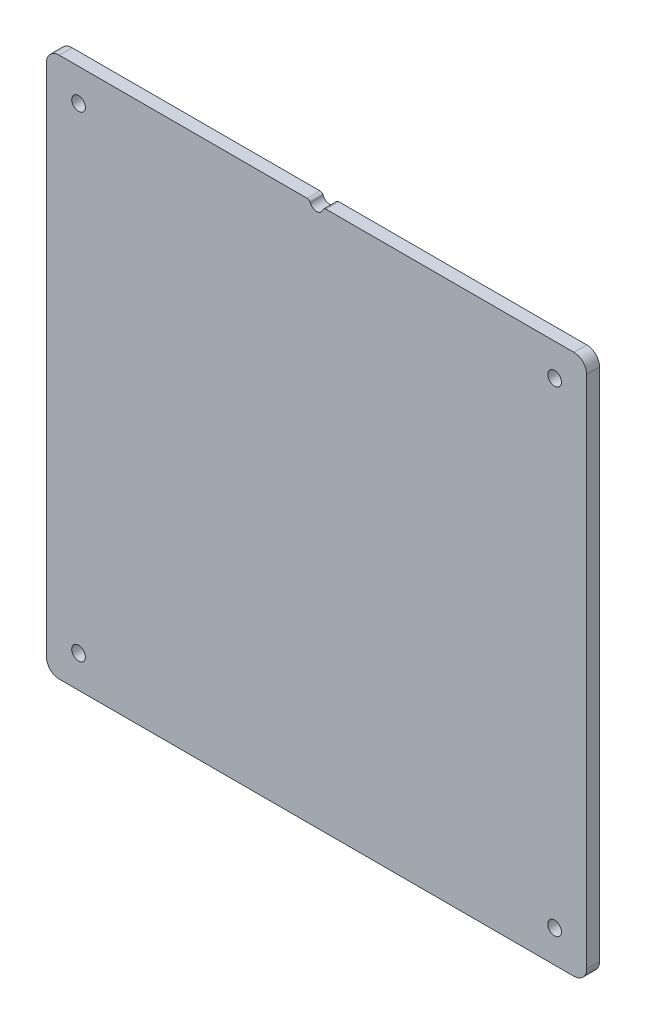
ISO-10303-21;
HEADER;
FILE_DESCRIPTION(('STEP AP214'),'2;1');
FILE_NAME('part.step','',(''),(''),'','','');
FILE_SCHEMA(('AUTOMOTIVE_DESIGN { 1 0 10303 214 1 1 1 1 }'));
ENDSEC;
DATA;
#1=APPLICATION_CONTEXT('core data for automotive mechanical design processes');
#2=APPLICATION_PROTOCOL_DEFINITION('international standard','automotive_design',2000,#1);
#3=PRODUCT_CONTEXT('',#1,'mechanical');
#4=PRODUCT('Part','Part','',(#3));
#5=PRODUCT_RELATED_PRODUCT_CATEGORY('part','',(#4));
#6=PRODUCT_DEFINITION_FORMATION('','',#4);
#7=PRODUCT_DEFINITION_CONTEXT('part definition',#1,'design');
#8=PRODUCT_DEFINITION('design','',#6,#7);
#9=PRODUCT_DEFINITION_SHAPE('','',#8);
#10=(LENGTH_UNIT() NAMED_UNIT(*) SI_UNIT(.MILLI.,.METRE.));
#11=(NAMED_UNIT(*) PLANE_ANGLE_UNIT() SI_UNIT($,.RADIAN.));
#12=(NAMED_UNIT(*) SI_UNIT($,.STERADIAN.) SOLID_ANGLE_UNIT());
#13=UNCERTAINTY_MEASURE_WITH_UNIT(LENGTH_MEASURE(1.E-05),#10,'distance_accuracy_value','');
#14=(GEOMETRIC_REPRESENTATION_CONTEXT(3) GLOBAL_UNCERTAINTY_ASSIGNED_CONTEXT((#13)) GLOBAL_UNIT_ASSIGNED_CONTEXT((#10,
#11,#12)) REPRESENTATION_CONTEXT('',''));
#15=CARTESIAN_POINT('',(0.,0.,0.));
#16=DIRECTION('',(0.,0.,1.));
#17=DIRECTION('',(1.,0.,0.));
#18=AXIS2_PLACEMENT_3D('',#15,#16,#17);
#19=CARTESIAN_POINT('',(-133.35,133.35,6.35));
#20=DIRECTION('',(0.,-1.,0.));
#21=DIRECTION('',(0.,0.,-1.));
#22=AXIS2_PLACEMENT_3D('',#19,#20,#21);
#23=PLANE('',#22);
#24=DIRECTION('',(-1.,0.,0.));
#25=VECTOR('',#24,1.);
#26=CARTESIAN_POINT('',(-133.35,133.35,0.));
#27=LINE('',#26,#25);
#28=CARTESIAN_POINT('',(127.,133.35,0.));
#29=VERTEX_POINT('',#28);
#30=CARTESIAN_POINT('',(4.6246139298324,133.35,0.));
#31=VERTEX_POINT('',#30);
#32=EDGE_CURVE('E158',#29,#31,#27,.T.);
#33=ORIENTED_EDGE('',*,*,#32,.T.);
#34=DIRECTION('',(0.,0.,1.));
#35=VECTOR('',#34,1.);
#36=CARTESIAN_POINT('',(4.6246139298324,133.35,6.35));
#37=LINE('',#36,#35);
#38=CARTESIAN_POINT('',(4.6246139298324,133.35,6.35));
#39=VERTEX_POINT('',#38);
#40=EDGE_CURVE('E200',#31,#39,#37,.T.);
#41=ORIENTED_EDGE('',*,*,#40,.T.);
#42=DIRECTION('',(-1.,0.,0.));
#43=VECTOR('',#42,1.);
#44=CARTESIAN_POINT('',(-133.35,133.35,6.35));
#45=LINE('',#44,#43);
#46=CARTESIAN_POINT('',(127.,133.35,6.35));
#47=VERTEX_POINT('',#46);
#48=EDGE_CURVE('E225',#47,#39,#45,.T.);
#49=ORIENTED_EDGE('',*,*,#48,.F.);
#50=DIRECTION('',(0.,0.,-1.));
#51=VECTOR('',#50,1.);
#52=CARTESIAN_POINT('',(127.,133.35,6.35));
#53=LINE('',#52,#51);
#54=EDGE_CURVE('E197',#47,#29,#53,.T.);
#55=ORIENTED_EDGE('',*,*,#54,.T.);
#56=EDGE_LOOP('',(#33,#41,#49,#55));
#57=FACE_BOUND('',#56,.T.);
#58=ADVANCED_FACE('F36',(#57),#23,.F.);
#59=CARTESIAN_POINT('',(0.,0.,6.35));
#60=DIRECTION('',(0.,0.,-1.));
#61=DIRECTION('',(-1.,0.,0.));
#62=AXIS2_PLACEMENT_3D('',#59,#60,#61);
#63=PLANE('',#62);
#64=CARTESIAN_POINT('',(-117.475,-117.475,6.35));
#65=DIRECTION('',(0.,0.,1.));
#66=DIRECTION('',(1.,0.,0.));
#67=AXIS2_PLACEMENT_3D('',#64,#65,#66);
#68=CIRCLE('',#67,3.37819999999998);
#69=CARTESIAN_POINT('',(-114.0968,-117.475,6.35));
#70=VERTEX_POINT('',#69);
#71=EDGE_CURVE('E236',#70,#70,#68,.T.);
#72=ORIENTED_EDGE('',*,*,#71,.F.);
#73=EDGE_LOOP('',(#72));
#74=FACE_BOUND('',#73,.T.);
#75=CARTESIAN_POINT('',(117.475,-117.475,6.35));
#76=DIRECTION('',(0.,0.,1.));
#77=DIRECTION('',(1.,0.,0.));
#78=AXIS2_PLACEMENT_3D('',#75,#76,#77);
#79=CIRCLE('',#78,3.37819999999998);
#80=CARTESIAN_POINT('',(120.8532,-117.475,6.35));
#81=VERTEX_POINT('',#80);
#82=EDGE_CURVE('E242',#81,#81,#79,.T.);
#83=ORIENTED_EDGE('',*,*,#82,.F.);
#84=EDGE_LOOP('',(#83));
#85=FACE_BOUND('',#84,.T.);
#86=CARTESIAN_POINT('',(117.475,117.475,6.35));
#87=DIRECTION('',(0.,0.,1.));
#88=DIRECTION('',(1.,0.,0.));
#89=AXIS2_PLACEMENT_3D('',#86,#87,#88);
#90=CIRCLE('',#89,3.37819999999998);
#91=CARTESIAN_POINT('',(120.8532,117.475,6.35));
#92=VERTEX_POINT('',#91);
#93=EDGE_CURVE('E161',#92,#92,#90,.T.);
#94=ORIENTED_EDGE('',*,*,#93,.F.);
#95=EDGE_LOOP('',(#94));
#96=FACE_BOUND('',#95,.T.);
#97=ORIENTED_EDGE('',*,*,#48,.T.);
#98=CARTESIAN_POINT('',(4.62461392983241,131.7625,6.35));
#99=DIRECTION('',(0.,0.,-1.));
#100=DIRECTION('',(-1.,0.,0.));
#101=AXIS2_PLACEMENT_3D('',#98,#99,#100);
#102=CIRCLE('',#101,1.5875);
#103=CARTESIAN_POINT('',(3.12311590066604,132.277922077922,6.35));
#104=VERTEX_POINT('',#103);
#105=EDGE_CURVE('E205',#39,#104,#102,.F.);
#106=ORIENTED_EDGE('',*,*,#105,.T.);
#107=CARTESIAN_POINT('',(0.,133.35,6.35));
#108=DIRECTION('',(0.,0.,1.));
#109=DIRECTION('',(1.,0.,0.));
#110=AXIS2_PLACEMENT_3D('',#107,#108,#109);
#111=CIRCLE('',#110,3.302);
#112=CARTESIAN_POINT('',(-3.12311590066604,132.277922077922,6.35));
#113=VERTEX_POINT('',#112);
#114=EDGE_CURVE('E223',#113,#104,#111,.T.);
#115=ORIENTED_EDGE('',*,*,#114,.F.);
#116=CARTESIAN_POINT('',(-4.62461392983241,131.7625,6.35));
#117=DIRECTION('',(0.,0.,-1.));
#118=DIRECTION('',(-1.,0.,0.));
#119=AXIS2_PLACEMENT_3D('',#116,#117,#118);
#120=CIRCLE('',#119,1.5875);
#121=CARTESIAN_POINT('',(-4.6246139298324,133.35,6.35));
#122=VERTEX_POINT('',#121);
#123=EDGE_CURVE('E203',#113,#122,#120,.F.);
#124=ORIENTED_EDGE('',*,*,#123,.T.);
#125=CARTESIAN_POINT('',(-127.,133.35,6.35));
#126=VERTEX_POINT('',#125);
#127=EDGE_CURVE('E251',#122,#126,#45,.T.);
#128=ORIENTED_EDGE('',*,*,#127,.T.);
#129=CARTESIAN_POINT('',(-127.,127.,6.35));
#130=DIRECTION('',(0.,0.,-1.));
#131=DIRECTION('',(-1.,0.,0.));
#132=AXIS2_PLACEMENT_3D('',#129,#130,#131);
#133=CIRCLE('',#132,6.35);
#134=CARTESIAN_POINT('',(-133.35,127.,6.35));
#135=VERTEX_POINT('',#134);
#136=EDGE_CURVE('E181',#126,#135,#133,.F.);
#137=ORIENTED_EDGE('',*,*,#136,.T.);
#138=DIRECTION('',(0.,-1.,0.));
#139=VECTOR('',#138,1.);
#140=CARTESIAN_POINT('',(-133.35,-133.35,6.35));
#141=LINE('',#140,#139);
#142=CARTESIAN_POINT('',(-133.35,-127.,6.35));
#143=VERTEX_POINT('',#142);
#144=EDGE_CURVE('E252',#135,#143,#141,.T.);
#145=ORIENTED_EDGE('',*,*,#144,.T.);
#146=CARTESIAN_POINT('',(-127.,-127.,6.35));
#147=DIRECTION('',(0.,0.,-1.));
#148=DIRECTION('',(-1.,0.,0.));
#149=AXIS2_PLACEMENT_3D('',#146,#147,#148);
#150=CIRCLE('',#149,6.35);
#151=CARTESIAN_POINT('',(-127.,-133.35,6.35));
#152=VERTEX_POINT('',#151);
#153=EDGE_CURVE('E185',#143,#152,#150,.F.);
#154=ORIENTED_EDGE('',*,*,#153,.T.);
#155=DIRECTION('',(1.,0.,0.));
#156=VECTOR('',#155,1.);
#157=CARTESIAN_POINT('',(-133.35,-133.35,6.35));
#158=LINE('',#157,#156);
#159=CARTESIAN_POINT('',(127.,-133.35,6.35));
#160=VERTEX_POINT('',#159);
#161=EDGE_CURVE('E164',#152,#160,#158,.T.);
#162=ORIENTED_EDGE('',*,*,#161,.T.);
#163=CARTESIAN_POINT('',(127.,-127.,6.35));
#164=DIRECTION('',(0.,0.,-1.));
#165=DIRECTION('',(-1.,0.,0.));
#166=AXIS2_PLACEMENT_3D('',#163,#164,#165);
#167=CIRCLE('',#166,6.35);
#168=CARTESIAN_POINT('',(133.35,-127.,6.35));
#169=VERTEX_POINT('',#168);
#170=EDGE_CURVE('E187',#160,#169,#167,.F.);
#171=ORIENTED_EDGE('',*,*,#170,.T.);
#172=DIRECTION('',(0.,1.,0.));
#173=VECTOR('',#172,1.);
#174=CARTESIAN_POINT('',(133.35,-133.35,6.35));
#175=LINE('',#174,#173);
#176=CARTESIAN_POINT('',(133.35,127.,6.35));
#177=VERTEX_POINT('',#176);
#178=EDGE_CURVE('E147',#169,#177,#175,.T.);
#179=ORIENTED_EDGE('',*,*,#178,.T.);
#180=CARTESIAN_POINT('',(127.,127.,6.35));
#181=DIRECTION('',(0.,0.,-1.));
#182=DIRECTION('',(-1.,0.,0.));
#183=AXIS2_PLACEMENT_3D('',#180,#181,#182);
#184=CIRCLE('',#183,6.35);
#185=EDGE_CURVE('E183',#177,#47,#184,.F.);
#186=ORIENTED_EDGE('',*,*,#185,.T.);
#187=EDGE_LOOP('',(#97,#106,#115,#124,#128,#137,#145,#154,#162,#171,#179,#186));
#188=FACE_BOUND('',#187,.T.);
#189=CARTESIAN_POINT('',(-117.475,117.475,6.35));
#190=DIRECTION('',(0.,0.,1.));
#191=DIRECTION('',(1.,0.,0.));
#192=AXIS2_PLACEMENT_3D('',#189,#190,#191);
#193=CIRCLE('',#192,3.37819999999998);
#194=CARTESIAN_POINT('',(-114.0968,117.475,6.35));
#195=VERTEX_POINT('',#194);
#196=EDGE_CURVE('E228',#195,#195,#193,.T.);
#197=ORIENTED_EDGE('',*,*,#196,.F.);
#198=EDGE_LOOP('',(#197));
#199=FACE_BOUND('',#198,.T.);
#200=ADVANCED_FACE('F221',(#74,#85,#96,#188,#199),#63,.F.);
#201=CARTESIAN_POINT('',(0.,0.,0.));
#202=DIRECTION('',(0.,0.,-1.));
#203=DIRECTION('',(-1.,0.,0.));
#204=AXIS2_PLACEMENT_3D('',#201,#202,#203);
#205=PLANE('',#204);
#206=CARTESIAN_POINT('',(0.,133.35,0.));
#207=DIRECTION('',(0.,0.,1.));
#208=DIRECTION('',(1.,0.,0.));
#209=AXIS2_PLACEMENT_3D('',#206,#207,#208);
#210=CIRCLE('',#209,3.302);
#211=CARTESIAN_POINT('',(-3.12311590066604,132.277922077922,0.));
#212=VERTEX_POINT('',#211);
#213=CARTESIAN_POINT('',(3.12311590066604,132.277922077922,0.));
#214=VERTEX_POINT('',#213);
#215=EDGE_CURVE('E211',#212,#214,#210,.T.);
#216=ORIENTED_EDGE('',*,*,#215,.T.);
#217=CARTESIAN_POINT('',(4.62461392983241,131.7625,0.));
#218=DIRECTION('',(0.,0.,-1.));
#219=DIRECTION('',(-1.,0.,0.));
#220=AXIS2_PLACEMENT_3D('',#217,#218,#219);
#221=CIRCLE('',#220,1.5875);
#222=EDGE_CURVE('E44',#214,#31,#221,.T.);
#223=ORIENTED_EDGE('',*,*,#222,.T.);
#224=ORIENTED_EDGE('',*,*,#32,.F.);
#225=CARTESIAN_POINT('',(127.,127.,0.));
#226=DIRECTION('',(0.,0.,-1.));
#227=DIRECTION('',(-1.,0.,0.));
#228=AXIS2_PLACEMENT_3D('',#225,#226,#227);
#229=CIRCLE('',#228,6.35);
#230=CARTESIAN_POINT('',(133.35,127.,0.));
#231=VERTEX_POINT('',#230);
#232=EDGE_CURVE('E154',#29,#231,#229,.T.);
#233=ORIENTED_EDGE('',*,*,#232,.T.);
#234=DIRECTION('',(0.,1.,0.));
#235=VECTOR('',#234,1.);
#236=CARTESIAN_POINT('',(133.35,-133.35,0.));
#237=LINE('',#236,#235);
#238=CARTESIAN_POINT('',(133.35,-127.,0.));
#239=VERTEX_POINT('',#238);
#240=EDGE_CURVE('E144',#239,#231,#237,.T.);
#241=ORIENTED_EDGE('',*,*,#240,.F.);
#242=CARTESIAN_POINT('',(127.,-127.,0.));
#243=DIRECTION('',(0.,0.,-1.));
#244=DIRECTION('',(-1.,0.,0.));
#245=AXIS2_PLACEMENT_3D('',#242,#243,#244);
#246=CIRCLE('',#245,6.35);
#247=CARTESIAN_POINT('',(127.,-133.35,0.));
#248=VERTEX_POINT('',#247);
#249=EDGE_CURVE('E127',#239,#248,#246,.T.);
#250=ORIENTED_EDGE('',*,*,#249,.T.);
#251=DIRECTION('',(1.,0.,0.));
#252=VECTOR('',#251,1.);
#253=CARTESIAN_POINT('',(-133.35,-133.35,0.));
#254=LINE('',#253,#252);
#255=CARTESIAN_POINT('',(-127.,-133.35,0.));
#256=VERTEX_POINT('',#255);
#257=EDGE_CURVE('E171',#256,#248,#254,.T.);
#258=ORIENTED_EDGE('',*,*,#257,.F.);
#259=CARTESIAN_POINT('',(-127.,-127.,0.));
#260=DIRECTION('',(0.,0.,-1.));
#261=DIRECTION('',(-1.,0.,0.));
#262=AXIS2_PLACEMENT_3D('',#259,#260,#261);
#263=CIRCLE('',#262,6.35);
#264=CARTESIAN_POINT('',(-133.35,-127.,0.));
#265=VERTEX_POINT('',#264);
#266=EDGE_CURVE('E138',#256,#265,#263,.T.);
#267=ORIENTED_EDGE('',*,*,#266,.T.);
#268=DIRECTION('',(0.,-1.,0.));
#269=VECTOR('',#268,1.);
#270=CARTESIAN_POINT('',(-133.35,-133.35,0.));
#271=LINE('',#270,#269);
#272=CARTESIAN_POINT('',(-133.35,127.,0.));
#273=VERTEX_POINT('',#272);
#274=EDGE_CURVE('E168',#273,#265,#271,.T.);
#275=ORIENTED_EDGE('',*,*,#274,.F.);
#276=CARTESIAN_POINT('',(-127.,127.,0.));
#277=DIRECTION('',(0.,0.,-1.));
#278=DIRECTION('',(-1.,0.,0.));
#279=AXIS2_PLACEMENT_3D('',#276,#277,#278);
#280=CIRCLE('',#279,6.35);
#281=CARTESIAN_POINT('',(-127.,133.35,0.));
#282=VERTEX_POINT('',#281);
#283=EDGE_CURVE('E148',#273,#282,#280,.T.);
#284=ORIENTED_EDGE('',*,*,#283,.T.);
#285=CARTESIAN_POINT('',(-4.6246139298324,133.35,0.));
#286=VERTEX_POINT('',#285);
#287=EDGE_CURVE('E155',#286,#282,#27,.T.);
#288=ORIENTED_EDGE('',*,*,#287,.F.);
#289=CARTESIAN_POINT('',(-4.62461392983241,131.7625,0.));
#290=DIRECTION('',(0.,0.,-1.));
#291=DIRECTION('',(-1.,0.,0.));
#292=AXIS2_PLACEMENT_3D('',#289,#290,#291);
#293=CIRCLE('',#292,1.5875);
#294=EDGE_CURVE('E51',#286,#212,#293,.T.);
#295=ORIENTED_EDGE('',*,*,#294,.T.);
#296=EDGE_LOOP('',(#216,#223,#224,#233,#241,#250,#258,#267,#275,#284,#288,#295));
#297=FACE_BOUND('',#296,.T.);
#298=CARTESIAN_POINT('',(-117.475,117.475,0.));
#299=DIRECTION('',(0.,0.,1.));
#300=DIRECTION('',(1.,0.,0.));
#301=AXIS2_PLACEMENT_3D('',#298,#299,#300);
#302=CIRCLE('',#301,3.37819999999993);
#303=CARTESIAN_POINT('',(-114.0968,117.475,0.));
#304=VERTEX_POINT('',#303);
#305=EDGE_CURVE('E233',#304,#304,#302,.T.);
#306=ORIENTED_EDGE('',*,*,#305,.T.);
#307=EDGE_LOOP('',(#306));
#308=FACE_BOUND('',#307,.T.);
#309=CARTESIAN_POINT('',(-117.475,-117.475,0.));
#310=DIRECTION('',(0.,0.,1.));
#311=DIRECTION('',(1.,0.,0.));
#312=AXIS2_PLACEMENT_3D('',#309,#310,#311);
#313=CIRCLE('',#312,3.37819999999993);
#314=CARTESIAN_POINT('',(-114.0968,-117.475,0.));
#315=VERTEX_POINT('',#314);
#316=EDGE_CURVE('E239',#315,#315,#313,.T.);
#317=ORIENTED_EDGE('',*,*,#316,.T.);
#318=EDGE_LOOP('',(#317));
#319=FACE_BOUND('',#318,.T.);
#320=CARTESIAN_POINT('',(117.475,117.475,0.));
#321=DIRECTION('',(0.,0.,1.));
#322=DIRECTION('',(1.,0.,0.));
#323=AXIS2_PLACEMENT_3D('',#320,#321,#322);
#324=CIRCLE('',#323,3.37819999999993);
#325=CARTESIAN_POINT('',(120.8532,117.475,0.));
#326=VERTEX_POINT('',#325);
#327=EDGE_CURVE('E156',#326,#326,#324,.T.);
#328=ORIENTED_EDGE('',*,*,#327,.T.);
#329=EDGE_LOOP('',(#328));
#330=FACE_BOUND('',#329,.T.);
#331=CARTESIAN_POINT('',(117.475,-117.475,0.));
#332=DIRECTION('',(0.,0.,1.));
#333=DIRECTION('',(1.,0.,0.));
#334=AXIS2_PLACEMENT_3D('',#331,#332,#333);
#335=CIRCLE('',#334,3.37819999999993);
#336=CARTESIAN_POINT('',(120.8532,-117.475,0.));
#337=VERTEX_POINT('',#336);
#338=EDGE_CURVE('E245',#337,#337,#335,.T.);
#339=ORIENTED_EDGE('',*,*,#338,.T.);
#340=EDGE_LOOP('',(#339));
#341=FACE_BOUND('',#340,.T.);
#342=ADVANCED_FACE('F151',(#297,#308,#319,#330,#341),#205,.T.);
#343=CARTESIAN_POINT('',(133.35,-133.35,6.35));
#344=DIRECTION('',(-1.,0.,0.));
#345=DIRECTION('',(0.,0.,1.));
#346=AXIS2_PLACEMENT_3D('',#343,#344,#345);
#347=PLANE('',#346);
#348=ORIENTED_EDGE('',*,*,#178,.F.);
#349=DIRECTION('',(0.,0.,-1.));
#350=VECTOR('',#349,1.);
#351=CARTESIAN_POINT('',(133.35,-127.,6.35));
#352=LINE('',#351,#350);
#353=EDGE_CURVE('E131',#169,#239,#352,.T.);
#354=ORIENTED_EDGE('',*,*,#353,.T.);
#355=ORIENTED_EDGE('',*,*,#240,.T.);
#356=DIRECTION('',(0.,0.,-1.));
#357=VECTOR('',#356,1.);
#358=CARTESIAN_POINT('',(133.35,127.,6.35));
#359=LINE('',#358,#357);
#360=EDGE_CURVE('E149',#231,#177,#359,.F.);
#361=ORIENTED_EDGE('',*,*,#360,.T.);
#362=EDGE_LOOP('',(#348,#354,#355,#361));
#363=FACE_BOUND('',#362,.T.);
#364=ADVANCED_FACE('F143',(#363),#347,.F.);
#365=ORIENTED_EDGE('',*,*,#127,.F.);
#366=DIRECTION('',(0.,0.,1.));
#367=VECTOR('',#366,1.);
#368=CARTESIAN_POINT('',(-4.6246139298324,133.35,6.35));
#369=LINE('',#368,#367);
#370=EDGE_CURVE('E11',#122,#286,#369,.F.);
#371=ORIENTED_EDGE('',*,*,#370,.T.);
#372=ORIENTED_EDGE('',*,*,#287,.T.);
#373=DIRECTION('',(0.,0.,-1.));
#374=VECTOR('',#373,1.);
#375=CARTESIAN_POINT('',(-127.,133.35,6.35));
#376=LINE('',#375,#374);
#377=EDGE_CURVE('E194',#282,#126,#376,.F.);
#378=ORIENTED_EDGE('',*,*,#377,.T.);
#379=EDGE_LOOP('',(#365,#371,#372,#378));
#380=FACE_BOUND('',#379,.T.);
#381=ADVANCED_FACE('F275',(#380),#23,.F.);
#382=CARTESIAN_POINT('',(-133.35,-133.35,6.35));
#383=DIRECTION('',(1.,0.,0.));
#384=DIRECTION('',(0.,0.,-1.));
#385=AXIS2_PLACEMENT_3D('',#382,#383,#384);
#386=PLANE('',#385);
#387=ORIENTED_EDGE('',*,*,#274,.T.);
#388=DIRECTION('',(0.,0.,-1.));
#389=VECTOR('',#388,1.);
#390=CARTESIAN_POINT('',(-133.35,-127.,6.35));
#391=LINE('',#390,#389);
#392=EDGE_CURVE('E192',#265,#143,#391,.F.);
#393=ORIENTED_EDGE('',*,*,#392,.T.);
#394=ORIENTED_EDGE('',*,*,#144,.F.);
#395=DIRECTION('',(0.,0.,-1.));
#396=VECTOR('',#395,1.);
#397=CARTESIAN_POINT('',(-133.35,127.,6.35));
#398=LINE('',#397,#396);
#399=EDGE_CURVE('E189',#135,#273,#398,.T.);
#400=ORIENTED_EDGE('',*,*,#399,.T.);
#401=EDGE_LOOP('',(#387,#393,#394,#400));
#402=FACE_BOUND('',#401,.T.);
#403=ADVANCED_FACE('F266',(#402),#386,.F.);
#404=CARTESIAN_POINT('',(-133.35,-133.35,6.35));
#405=DIRECTION('',(0.,1.,0.));
#406=DIRECTION('',(0.,0.,1.));
#407=AXIS2_PLACEMENT_3D('',#404,#405,#406);
#408=PLANE('',#407);
#409=ORIENTED_EDGE('',*,*,#257,.T.);
#410=DIRECTION('',(0.,0.,-1.));
#411=VECTOR('',#410,1.);
#412=CARTESIAN_POINT('',(127.,-133.35,6.35));
#413=LINE('',#412,#411);
#414=EDGE_CURVE('E132',#248,#160,#413,.F.);
#415=ORIENTED_EDGE('',*,*,#414,.T.);
#416=ORIENTED_EDGE('',*,*,#161,.F.);
#417=DIRECTION('',(0.,0.,-1.));
#418=VECTOR('',#417,1.);
#419=CARTESIAN_POINT('',(-127.,-133.35,6.35));
#420=LINE('',#419,#418);
#421=EDGE_CURVE('E137',#152,#256,#420,.T.);
#422=ORIENTED_EDGE('',*,*,#421,.T.);
#423=EDGE_LOOP('',(#409,#415,#416,#422));
#424=FACE_BOUND('',#423,.T.);
#425=ADVANCED_FACE('F260',(#424),#408,.F.);
#426=CARTESIAN_POINT('',(117.475,117.475,6.35));
#427=DIRECTION('',(0.,0.,1.));
#428=DIRECTION('',(1.,0.,0.));
#429=AXIS2_PLACEMENT_3D('',#426,#427,#428);
#430=CYLINDRICAL_SURFACE('',#429,3.37819999999996);
#431=ORIENTED_EDGE('',*,*,#327,.F.);
#432=EDGE_LOOP('',(#431));
#433=FACE_BOUND('',#432,.T.);
#434=ORIENTED_EDGE('',*,*,#93,.T.);
#435=EDGE_LOOP('',(#434));
#436=FACE_BOUND('',#435,.T.);
#437=ADVANCED_FACE('F326',(#433,#436),#430,.F.);
#438=CARTESIAN_POINT('',(117.475,-117.475,6.35));
#439=DIRECTION('',(0.,0.,1.));
#440=DIRECTION('',(1.,0.,0.));
#441=AXIS2_PLACEMENT_3D('',#438,#439,#440);
#442=CYLINDRICAL_SURFACE('',#441,3.37819999999996);
#443=ORIENTED_EDGE('',*,*,#338,.F.);
#444=EDGE_LOOP('',(#443));
#445=FACE_BOUND('',#444,.T.);
#446=ORIENTED_EDGE('',*,*,#82,.T.);
#447=EDGE_LOOP('',(#446));
#448=FACE_BOUND('',#447,.T.);
#449=ADVANCED_FACE('F322',(#445,#448),#442,.F.);
#450=CARTESIAN_POINT('',(-117.475,-117.475,6.35));
#451=DIRECTION('',(0.,0.,1.));
#452=DIRECTION('',(1.,0.,0.));
#453=AXIS2_PLACEMENT_3D('',#450,#451,#452);
#454=CYLINDRICAL_SURFACE('',#453,3.37819999999996);
#455=ORIENTED_EDGE('',*,*,#316,.F.);
#456=EDGE_LOOP('',(#455));
#457=FACE_BOUND('',#456,.T.);
#458=ORIENTED_EDGE('',*,*,#71,.T.);
#459=EDGE_LOOP('',(#458));
#460=FACE_BOUND('',#459,.T.);
#461=ADVANCED_FACE('F318',(#457,#460),#454,.F.);
#462=CARTESIAN_POINT('',(-117.475,117.475,6.35));
#463=DIRECTION('',(0.,0.,1.));
#464=DIRECTION('',(1.,0.,0.));
#465=AXIS2_PLACEMENT_3D('',#462,#463,#464);
#466=CYLINDRICAL_SURFACE('',#465,3.37819999999996);
#467=ORIENTED_EDGE('',*,*,#305,.F.);
#468=EDGE_LOOP('',(#467));
#469=FACE_BOUND('',#468,.T.);
#470=ORIENTED_EDGE('',*,*,#196,.T.);
#471=EDGE_LOOP('',(#470));
#472=FACE_BOUND('',#471,.T.);
#473=ADVANCED_FACE('F301',(#469,#472),#466,.F.);
#474=CARTESIAN_POINT('',(127.,-127.,6.35));
#475=DIRECTION('',(0.,0.,-1.));
#476=DIRECTION('',(-1.,0.,0.));
#477=AXIS2_PLACEMENT_3D('',#474,#475,#476);
#478=CYLINDRICAL_SURFACE('',#477,6.35);
#479=ORIENTED_EDGE('',*,*,#170,.F.);
#480=ORIENTED_EDGE('',*,*,#414,.F.);
#481=ORIENTED_EDGE('',*,*,#249,.F.);
#482=ORIENTED_EDGE('',*,*,#353,.F.);
#483=EDGE_LOOP('',(#479,#480,#481,#482));
#484=FACE_BOUND('',#483,.T.);
#485=ADVANCED_FACE('F130',(#484),#478,.T.);
#486=CARTESIAN_POINT('',(-127.,-127.,6.35));
#487=DIRECTION('',(0.,0.,-1.));
#488=DIRECTION('',(-1.,0.,0.));
#489=AXIS2_PLACEMENT_3D('',#486,#487,#488);
#490=CYLINDRICAL_SURFACE('',#489,6.35);
#491=ORIENTED_EDGE('',*,*,#153,.F.);
#492=ORIENTED_EDGE('',*,*,#392,.F.);
#493=ORIENTED_EDGE('',*,*,#266,.F.);
#494=ORIENTED_EDGE('',*,*,#421,.F.);
#495=EDGE_LOOP('',(#491,#492,#493,#494));
#496=FACE_BOUND('',#495,.T.);
#497=ADVANCED_FACE('F262',(#496),#490,.T.);
#498=CARTESIAN_POINT('',(127.,127.,6.35));
#499=DIRECTION('',(0.,0.,-1.));
#500=DIRECTION('',(-1.,0.,0.));
#501=AXIS2_PLACEMENT_3D('',#498,#499,#500);
#502=CYLINDRICAL_SURFACE('',#501,6.35);
#503=ORIENTED_EDGE('',*,*,#185,.F.);
#504=ORIENTED_EDGE('',*,*,#360,.F.);
#505=ORIENTED_EDGE('',*,*,#232,.F.);
#506=ORIENTED_EDGE('',*,*,#54,.F.);
#507=EDGE_LOOP('',(#503,#504,#505,#506));
#508=FACE_BOUND('',#507,.T.);
#509=ADVANCED_FACE('F304',(#508),#502,.T.);
#510=CARTESIAN_POINT('',(-127.,127.,6.35));
#511=DIRECTION('',(0.,0.,-1.));
#512=DIRECTION('',(-1.,0.,0.));
#513=AXIS2_PLACEMENT_3D('',#510,#511,#512);
#514=CYLINDRICAL_SURFACE('',#513,6.35);
#515=ORIENTED_EDGE('',*,*,#136,.F.);
#516=ORIENTED_EDGE('',*,*,#377,.F.);
#517=ORIENTED_EDGE('',*,*,#283,.F.);
#518=ORIENTED_EDGE('',*,*,#399,.F.);
#519=EDGE_LOOP('',(#515,#516,#517,#518));
#520=FACE_BOUND('',#519,.T.);
#521=ADVANCED_FACE('F270',(#520),#514,.T.);
#522=CARTESIAN_POINT('',(0.,133.35,0.));
#523=DIRECTION('',(0.,0.,1.));
#524=DIRECTION('',(1.,0.,0.));
#525=AXIS2_PLACEMENT_3D('',#522,#523,#524);
#526=CYLINDRICAL_SURFACE('',#525,3.302);
#527=ORIENTED_EDGE('',*,*,#114,.T.);
#528=DIRECTION('',(0.,0.,1.));
#529=VECTOR('',#528,1.);
#530=CARTESIAN_POINT('',(3.12311590066605,132.277922077922,0.));
#531=LINE('',#530,#529);
#532=EDGE_CURVE('E58',#104,#214,#531,.F.);
#533=ORIENTED_EDGE('',*,*,#532,.T.);
#534=ORIENTED_EDGE('',*,*,#215,.F.);
#535=DIRECTION('',(0.,0.,1.));
#536=VECTOR('',#535,1.);
#537=CARTESIAN_POINT('',(-3.12311590066605,132.277922077922,0.));
#538=LINE('',#537,#536);
#539=EDGE_CURVE('E207',#212,#113,#538,.T.);
#540=ORIENTED_EDGE('',*,*,#539,.T.);
#541=EDGE_LOOP('',(#527,#533,#534,#540));
#542=FACE_BOUND('',#541,.T.);
#543=ADVANCED_FACE('F226',(#542),#526,.F.);
#544=CARTESIAN_POINT('',(4.62461392983241,131.7625,0.));
#545=DIRECTION('',(0.,0.,1.));
#546=DIRECTION('',(1.,0.,0.));
#547=AXIS2_PLACEMENT_3D('',#544,#545,#546);
#548=CYLINDRICAL_SURFACE('',#547,1.5875);
#549=ORIENTED_EDGE('',*,*,#222,.F.);
#550=ORIENTED_EDGE('',*,*,#532,.F.);
#551=ORIENTED_EDGE('',*,*,#105,.F.);
#552=ORIENTED_EDGE('',*,*,#40,.F.);
#553=EDGE_LOOP('',(#549,#550,#551,#552));
#554=FACE_BOUND('',#553,.T.);
#555=ADVANCED_FACE('F218',(#554),#548,.T.);
#556=CARTESIAN_POINT('',(-4.62461392983241,131.7625,0.));
#557=DIRECTION('',(0.,0.,1.));
#558=DIRECTION('',(1.,0.,0.));
#559=AXIS2_PLACEMENT_3D('',#556,#557,#558);
#560=CYLINDRICAL_SURFACE('',#559,1.5875);
#561=ORIENTED_EDGE('',*,*,#123,.F.);
#562=ORIENTED_EDGE('',*,*,#539,.F.);
#563=ORIENTED_EDGE('',*,*,#294,.F.);
#564=ORIENTED_EDGE('',*,*,#370,.F.);
#565=EDGE_LOOP('',(#561,#562,#563,#564));
#566=FACE_BOUND('',#565,.T.);
#567=ADVANCED_FACE('F38',(#566),#560,.T.);
#568=CLOSED_SHELL('',(#58,#200,#342,#364,#381,#403,#425,#437,#449,#461,#473,#485,#497,#509,#521,
#543,#555,#567));
#569=MANIFOLD_SOLID_BREP('B2',#568);
#570=ADVANCED_BREP_SHAPE_REPRESENTATION('',(#18,#569),#14);
#571=SHAPE_DEFINITION_REPRESENTATION(#9,#570);
ENDSEC;
END-ISO-10303-21;
